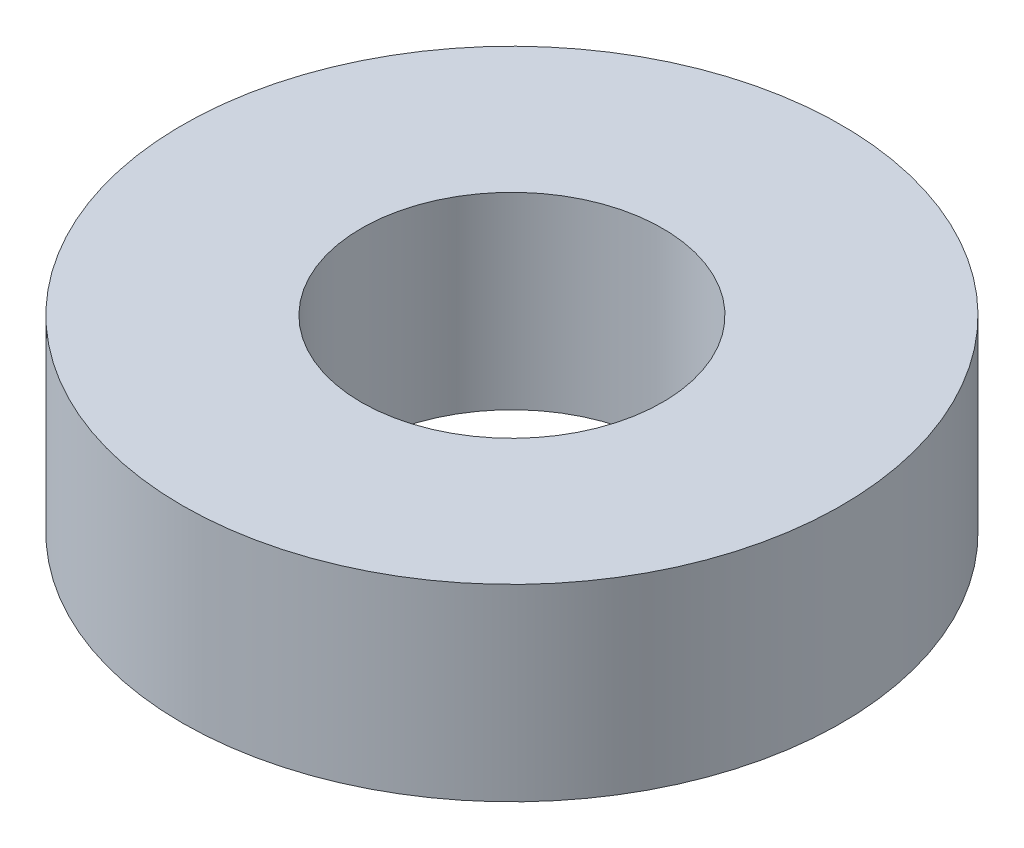
ISO-10303-21;
HEADER;
FILE_DESCRIPTION(('STEP AP214'),'2;1');
FILE_NAME('part.step','',(''),(''),'','','');
FILE_SCHEMA(('AUTOMOTIVE_DESIGN { 1 0 10303 214 1 1 1 1 }'));
ENDSEC;
DATA;
#1=APPLICATION_CONTEXT('core data for automotive mechanical design processes');
#2=APPLICATION_PROTOCOL_DEFINITION('international standard','automotive_design',2000,#1);
#3=PRODUCT_CONTEXT('',#1,'mechanical');
#4=PRODUCT('Part','Part','',(#3));
#5=PRODUCT_RELATED_PRODUCT_CATEGORY('part','',(#4));
#6=PRODUCT_DEFINITION_FORMATION('','',#4);
#7=PRODUCT_DEFINITION_CONTEXT('part definition',#1,'design');
#8=PRODUCT_DEFINITION('design','',#6,#7);
#9=PRODUCT_DEFINITION_SHAPE('','',#8);
#10=(LENGTH_UNIT() NAMED_UNIT(*) SI_UNIT(.MILLI.,.METRE.));
#11=(NAMED_UNIT(*) PLANE_ANGLE_UNIT() SI_UNIT($,.RADIAN.));
#12=(NAMED_UNIT(*) SI_UNIT($,.STERADIAN.) SOLID_ANGLE_UNIT());
#13=UNCERTAINTY_MEASURE_WITH_UNIT(LENGTH_MEASURE(1.E-05),#10,'distance_accuracy_value','');
#14=(GEOMETRIC_REPRESENTATION_CONTEXT(3) GLOBAL_UNCERTAINTY_ASSIGNED_CONTEXT((#13)) GLOBAL_UNIT_ASSIGNED_CONTEXT((#10,
#11,#12)) REPRESENTATION_CONTEXT('',''));
#15=CARTESIAN_POINT('',(0.,0.,0.));
#16=DIRECTION('',(0.,0.,1.));
#17=DIRECTION('',(1.,0.,0.));
#18=AXIS2_PLACEMENT_3D('',#15,#16,#17);
#19=CARTESIAN_POINT('',(0.,2.,0.));
#20=DIRECTION('',(0.,1.,0.));
#21=DIRECTION('',(0.,0.,1.));
#22=AXIS2_PLACEMENT_3D('',#19,#20,#21);
#23=PLANE('',#22);
#24=CARTESIAN_POINT('',(0.,2.,0.));
#25=DIRECTION('',(0.,1.,0.));
#26=DIRECTION('',(0.,0.,1.));
#27=AXIS2_PLACEMENT_3D('',#24,#25,#26);
#28=CIRCLE('',#27,3.5);
#29=CARTESIAN_POINT('',(0.,2.,3.5));
#30=VERTEX_POINT('',#29);
#31=EDGE_CURVE('E10',#30,#30,#28,.T.);
#32=ORIENTED_EDGE('',*,*,#31,.T.);
#33=EDGE_LOOP('',(#32));
#34=FACE_BOUND('',#33,.T.);
#35=CARTESIAN_POINT('',(0.,2.,0.));
#36=DIRECTION('',(0.,1.,0.));
#37=DIRECTION('',(0.,0.,1.));
#38=AXIS2_PLACEMENT_3D('',#35,#36,#37);
#39=CIRCLE('',#38,1.6);
#40=CARTESIAN_POINT('',(0.,2.,1.6));
#41=VERTEX_POINT('',#40);
#42=EDGE_CURVE('E50',#41,#41,#39,.T.);
#43=ORIENTED_EDGE('',*,*,#42,.F.);
#44=EDGE_LOOP('',(#43));
#45=FACE_BOUND('',#44,.T.);
#46=ADVANCED_FACE('F39',(#34,#45),#23,.T.);
#47=CARTESIAN_POINT('',(0.,0.,0.));
#48=DIRECTION('',(0.,1.,0.));
#49=DIRECTION('',(0.,0.,1.));
#50=AXIS2_PLACEMENT_3D('',#47,#48,#49);
#51=PLANE('',#50);
#52=CARTESIAN_POINT('',(0.,0.,0.));
#53=DIRECTION('',(0.,1.,0.));
#54=DIRECTION('',(0.,0.,1.));
#55=AXIS2_PLACEMENT_3D('',#52,#53,#54);
#56=CIRCLE('',#55,3.5);
#57=CARTESIAN_POINT('',(0.,0.,3.5));
#58=VERTEX_POINT('',#57);
#59=EDGE_CURVE('E43',#58,#58,#56,.T.);
#60=ORIENTED_EDGE('',*,*,#59,.F.);
#61=EDGE_LOOP('',(#60));
#62=FACE_BOUND('',#61,.T.);
#63=CARTESIAN_POINT('',(0.,0.,0.));
#64=DIRECTION('',(0.,1.,0.));
#65=DIRECTION('',(0.,0.,1.));
#66=AXIS2_PLACEMENT_3D('',#63,#64,#65);
#67=CIRCLE('',#66,1.6);
#68=CARTESIAN_POINT('',(0.,0.,1.6));
#69=VERTEX_POINT('',#68);
#70=EDGE_CURVE('E52',#69,#69,#67,.T.);
#71=ORIENTED_EDGE('',*,*,#70,.T.);
#72=EDGE_LOOP('',(#71));
#73=FACE_BOUND('',#72,.T.);
#74=ADVANCED_FACE('F62',(#62,#73),#51,.F.);
#75=CARTESIAN_POINT('',(0.,2.,0.));
#76=DIRECTION('',(0.,-1.,0.));
#77=DIRECTION('',(0.,0.,-1.));
#78=AXIS2_PLACEMENT_3D('',#75,#76,#77);
#79=CYLINDRICAL_SURFACE('',#78,3.5);
#80=ORIENTED_EDGE('',*,*,#31,.F.);
#81=EDGE_LOOP('',(#80));
#82=FACE_BOUND('',#81,.T.);
#83=ORIENTED_EDGE('',*,*,#59,.T.);
#84=EDGE_LOOP('',(#83));
#85=FACE_BOUND('',#84,.T.);
#86=ADVANCED_FACE('F41',(#82,#85),#79,.T.);
#87=CARTESIAN_POINT('',(0.,2.,0.));
#88=DIRECTION('',(0.,-1.,0.));
#89=DIRECTION('',(0.,0.,-1.));
#90=AXIS2_PLACEMENT_3D('',#87,#88,#89);
#91=CYLINDRICAL_SURFACE('',#90,1.6);
#92=ORIENTED_EDGE('',*,*,#42,.T.);
#93=EDGE_LOOP('',(#92));
#94=FACE_BOUND('',#93,.T.);
#95=ORIENTED_EDGE('',*,*,#70,.F.);
#96=EDGE_LOOP('',(#95));
#97=FACE_BOUND('',#96,.T.);
#98=ADVANCED_FACE('F58',(#94,#97),#91,.F.);
#99=CLOSED_SHELL('',(#46,#74,#86,#98));
#100=MANIFOLD_SOLID_BREP('B2',#99);
#101=ADVANCED_BREP_SHAPE_REPRESENTATION('',(#18,#100),#14);
#102=SHAPE_DEFINITION_REPRESENTATION(#9,#101);
ENDSEC;
END-ISO-10303-21;
